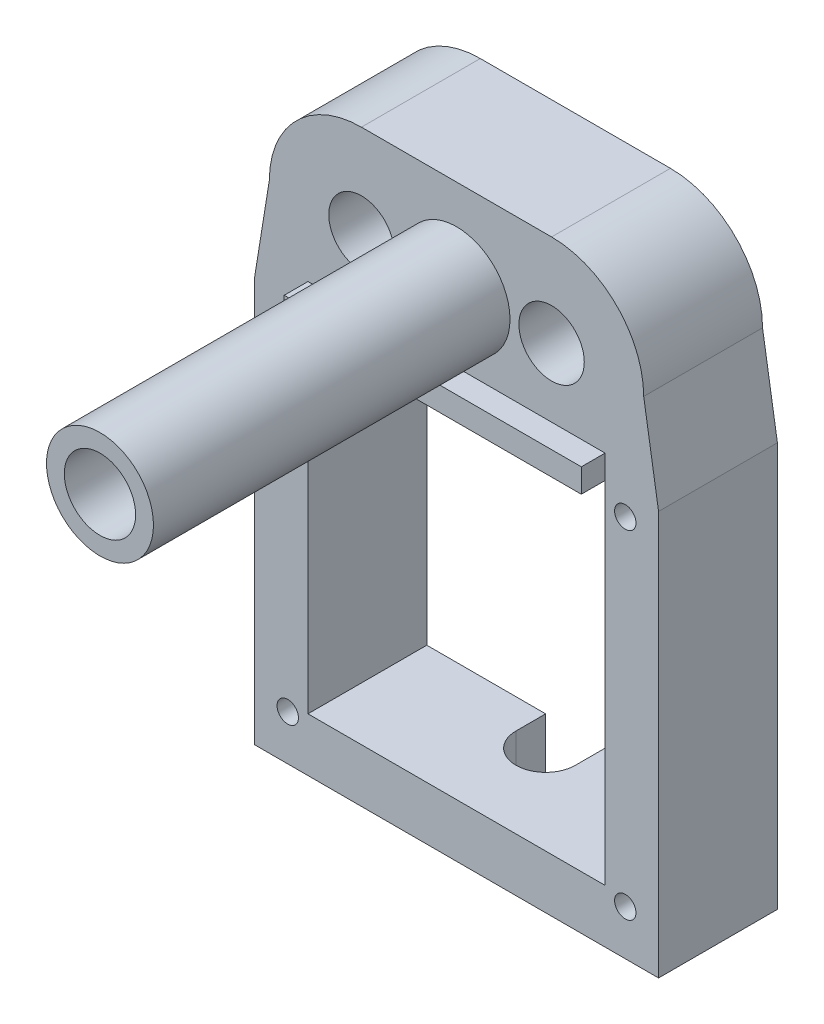
ISO-10303-21;
HEADER;
FILE_DESCRIPTION(('STEP AP214'),'2;1');
FILE_NAME('part.step','',(''),(''),'','','');
FILE_SCHEMA(('AUTOMOTIVE_DESIGN { 1 0 10303 214 1 1 1 1 }'));
ENDSEC;
DATA;
#1=APPLICATION_CONTEXT('core data for automotive mechanical design processes');
#2=APPLICATION_PROTOCOL_DEFINITION('international standard','automotive_design',2000,#1);
#3=PRODUCT_CONTEXT('',#1,'mechanical');
#4=PRODUCT('Part','Part','',(#3));
#5=PRODUCT_RELATED_PRODUCT_CATEGORY('part','',(#4));
#6=PRODUCT_DEFINITION_FORMATION('','',#4);
#7=PRODUCT_DEFINITION_CONTEXT('part definition',#1,'design');
#8=PRODUCT_DEFINITION('design','',#6,#7);
#9=PRODUCT_DEFINITION_SHAPE('','',#8);
#10=(LENGTH_UNIT() NAMED_UNIT(*) SI_UNIT(.MILLI.,.METRE.));
#11=(NAMED_UNIT(*) PLANE_ANGLE_UNIT() SI_UNIT($,.RADIAN.));
#12=(NAMED_UNIT(*) SI_UNIT($,.STERADIAN.) SOLID_ANGLE_UNIT());
#13=UNCERTAINTY_MEASURE_WITH_UNIT(LENGTH_MEASURE(1.E-05),#10,'distance_accuracy_value','');
#14=(GEOMETRIC_REPRESENTATION_CONTEXT(3) GLOBAL_UNCERTAINTY_ASSIGNED_CONTEXT((#13)) GLOBAL_UNIT_ASSIGNED_CONTEXT((#10,
#11,#12)) REPRESENTATION_CONTEXT('',''));
#15=CARTESIAN_POINT('',(0.,0.,0.));
#16=DIRECTION('',(0.,0.,1.));
#17=DIRECTION('',(1.,0.,0.));
#18=AXIS2_PLACEMENT_3D('',#15,#16,#17);
#19=CARTESIAN_POINT('',(0.,0.,10.));
#20=DIRECTION('',(0.,0.,1.));
#21=DIRECTION('',(1.,0.,0.));
#22=AXIS2_PLACEMENT_3D('',#19,#20,#21);
#23=PLANE('',#22);
#24=CARTESIAN_POINT('',(-14.2,-37.95,10.));
#25=DIRECTION('',(0.,0.,1.));
#26=DIRECTION('',(-1.,0.,0.));
#27=AXIS2_PLACEMENT_3D('',#24,#25,#26);
#28=CIRCLE('',#27,0.900000000000002);
#29=CARTESIAN_POINT('',(-15.1,-37.95,10.));
#30=VERTEX_POINT('',#29);
#31=EDGE_CURVE('E756',#30,#30,#28,.T.);
#32=ORIENTED_EDGE('',*,*,#31,.F.);
#33=EDGE_LOOP('',(#32));
#34=FACE_BOUND('',#33,.T.);
#35=CARTESIAN_POINT('',(14.2,-37.95,10.));
#36=DIRECTION('',(0.,0.,1.));
#37=DIRECTION('',(1.,0.,0.));
#38=AXIS2_PLACEMENT_3D('',#35,#36,#37);
#39=CIRCLE('',#38,0.900000000000002);
#40=CARTESIAN_POINT('',(15.1,-37.95,10.));
#41=VERTEX_POINT('',#40);
#42=EDGE_CURVE('E758',#41,#41,#39,.T.);
#43=ORIENTED_EDGE('',*,*,#42,.F.);
#44=EDGE_LOOP('',(#43));
#45=FACE_BOUND('',#44,.T.);
#46=CARTESIAN_POINT('',(14.2,-9.55,10.));
#47=DIRECTION('',(0.,0.,1.));
#48=DIRECTION('',(-1.,0.,0.));
#49=AXIS2_PLACEMENT_3D('',#46,#47,#48);
#50=CIRCLE('',#49,0.9);
#51=CARTESIAN_POINT('',(13.3,-9.55,10.));
#52=VERTEX_POINT('',#51);
#53=EDGE_CURVE('E762',#52,#52,#50,.T.);
#54=ORIENTED_EDGE('',*,*,#53,.F.);
#55=EDGE_LOOP('',(#54));
#56=FACE_BOUND('',#55,.T.);
#57=CARTESIAN_POINT('',(-14.2,-9.55,10.));
#58=DIRECTION('',(0.,0.,1.));
#59=DIRECTION('',(1.,0.,0.));
#60=AXIS2_PLACEMENT_3D('',#57,#58,#59);
#61=CIRCLE('',#60,0.9);
#62=CARTESIAN_POINT('',(-13.3,-9.55,10.));
#63=VERTEX_POINT('',#62);
#64=EDGE_CURVE('E398',#63,#63,#61,.T.);
#65=ORIENTED_EDGE('',*,*,#64,.F.);
#66=EDGE_LOOP('',(#65));
#67=FACE_BOUND('',#66,.T.);
#68=DIRECTION('',(-0.159232438824621,0.987241120712647,0.));
#69=VECTOR('',#68,1.);
#70=CARTESIAN_POINT('',(15.3506592292089,2.47591277890467,10.));
#71=LINE('',#70,#69);
#72=CARTESIAN_POINT('',(17.,-7.75,10.));
#73=VERTEX_POINT('',#72);
#74=CARTESIAN_POINT('',(15.75,0.,10.));
#75=VERTEX_POINT('',#74);
#76=EDGE_CURVE('E264',#73,#75,#71,.T.);
#77=ORIENTED_EDGE('',*,*,#76,.T.);
#78=CARTESIAN_POINT('',(8.,0.,10.));
#79=DIRECTION('',(0.,0.,1.));
#80=DIRECTION('',(1.,0.,0.));
#81=AXIS2_PLACEMENT_3D('',#78,#79,#80);
#82=CIRCLE('',#81,7.75);
#83=CARTESIAN_POINT('',(8.,7.75,10.));
#84=VERTEX_POINT('',#83);
#85=EDGE_CURVE('E348',#75,#84,#82,.T.);
#86=ORIENTED_EDGE('',*,*,#85,.T.);
#87=DIRECTION('',(1.,0.,0.));
#88=VECTOR('',#87,1.);
#89=CARTESIAN_POINT('',(0.,7.75,10.));
#90=LINE('',#89,#88);
#91=CARTESIAN_POINT('',(-8.,7.75,10.));
#92=VERTEX_POINT('',#91);
#93=EDGE_CURVE('E351',#92,#84,#90,.T.);
#94=ORIENTED_EDGE('',*,*,#93,.F.);
#95=CARTESIAN_POINT('',(-8.,0.,10.));
#96=DIRECTION('',(0.,0.,1.));
#97=DIRECTION('',(1.,0.,0.));
#98=AXIS2_PLACEMENT_3D('',#95,#96,#97);
#99=CIRCLE('',#98,7.75);
#100=CARTESIAN_POINT('',(-15.75,0.,10.));
#101=VERTEX_POINT('',#100);
#102=EDGE_CURVE('E356',#92,#101,#99,.T.);
#103=ORIENTED_EDGE('',*,*,#102,.T.);
#104=DIRECTION('',(-0.159232438824621,-0.987241120712647,0.));
#105=VECTOR('',#104,1.);
#106=CARTESIAN_POINT('',(-15.3506592292089,2.47591277890467,10.));
#107=LINE('',#106,#105);
#108=CARTESIAN_POINT('',(-17.,-7.75,10.));
#109=VERTEX_POINT('',#108);
#110=EDGE_CURVE('E251',#101,#109,#107,.T.);
#111=ORIENTED_EDGE('',*,*,#110,.T.);
#112=DIRECTION('',(0.,-1.,0.));
#113=VECTOR('',#112,1.);
#114=CARTESIAN_POINT('',(-17.,0.,10.));
#115=LINE('',#114,#113);
#116=CARTESIAN_POINT('',(-17.,-41.75,10.));
#117=VERTEX_POINT('',#116);
#118=EDGE_CURVE('E254',#109,#117,#115,.T.);
#119=ORIENTED_EDGE('',*,*,#118,.T.);
#120=DIRECTION('',(1.,0.,0.));
#121=VECTOR('',#120,1.);
#122=CARTESIAN_POINT('',(0.,-41.75,10.));
#123=LINE('',#122,#121);
#124=CARTESIAN_POINT('',(17.,-41.75,10.));
#125=VERTEX_POINT('',#124);
#126=EDGE_CURVE('E257',#117,#125,#123,.T.);
#127=ORIENTED_EDGE('',*,*,#126,.T.);
#128=DIRECTION('',(0.,-1.,0.));
#129=VECTOR('',#128,1.);
#130=CARTESIAN_POINT('',(17.,0.,10.));
#131=LINE('',#130,#129);
#132=EDGE_CURVE('E260',#73,#125,#131,.T.);
#133=ORIENTED_EDGE('',*,*,#132,.F.);
#134=EDGE_LOOP('',(#77,#86,#94,#103,#111,#119,#127,#133));
#135=FACE_BOUND('',#134,.T.);
#136=CARTESIAN_POINT('',(-8.,0.,10.));
#137=DIRECTION('',(0.,0.,1.));
#138=DIRECTION('',(1.,0.,0.));
#139=AXIS2_PLACEMENT_3D('',#136,#137,#138);
#140=CIRCLE('',#139,2.75);
#141=CARTESIAN_POINT('',(-5.25,0.,10.));
#142=VERTEX_POINT('',#141);
#143=EDGE_CURVE('E364',#142,#142,#140,.T.);
#144=ORIENTED_EDGE('',*,*,#143,.F.);
#145=EDGE_LOOP('',(#144));
#146=FACE_BOUND('',#145,.T.);
#147=CARTESIAN_POINT('',(8.,0.,10.));
#148=DIRECTION('',(0.,0.,1.));
#149=DIRECTION('',(1.,0.,0.));
#150=AXIS2_PLACEMENT_3D('',#147,#148,#149);
#151=CIRCLE('',#150,2.75);
#152=CARTESIAN_POINT('',(10.75,0.,10.));
#153=VERTEX_POINT('',#152);
#154=EDGE_CURVE('E360',#153,#153,#151,.T.);
#155=ORIENTED_EDGE('',*,*,#154,.F.);
#156=EDGE_LOOP('',(#155));
#157=FACE_BOUND('',#156,.T.);
#158=CARTESIAN_POINT('',(0.,0.,10.));
#159=DIRECTION('',(0.,0.,1.));
#160=DIRECTION('',(1.,0.,0.));
#161=AXIS2_PLACEMENT_3D('',#158,#159,#160);
#162=CIRCLE('',#161,4.5);
#163=CARTESIAN_POINT('',(4.5,0.,10.));
#164=VERTEX_POINT('',#163);
#165=EDGE_CURVE('E339',#164,#164,#162,.T.);
#166=ORIENTED_EDGE('',*,*,#165,.F.);
#167=EDGE_LOOP('',(#166));
#168=FACE_BOUND('',#167,.T.);
#169=DIRECTION('',(0.,-1.,0.));
#170=VECTOR('',#169,1.);
#171=CARTESIAN_POINT('',(-12.5,0.,10.));
#172=LINE('',#171,#170);
#173=CARTESIAN_POINT('',(-12.5,-7.75,10.));
#174=VERTEX_POINT('',#173);
#175=CARTESIAN_POINT('',(-12.5,-37.25,10.));
#176=VERTEX_POINT('',#175);
#177=EDGE_CURVE('E247',#174,#176,#172,.T.);
#178=ORIENTED_EDGE('',*,*,#177,.F.);
#179=DIRECTION('',(0.,-1.,0.));
#180=VECTOR('',#179,1.);
#181=CARTESIAN_POINT('',(-12.5,-7.75,10.));
#182=LINE('',#181,#180);
#183=CARTESIAN_POINT('',(-12.5,-5.75,10.));
#184=VERTEX_POINT('',#183);
#185=EDGE_CURVE('E63',#184,#174,#182,.T.);
#186=ORIENTED_EDGE('',*,*,#185,.F.);
#187=DIRECTION('',(-1.,0.,0.));
#188=VECTOR('',#187,1.);
#189=CARTESIAN_POINT('',(-12.5,-5.75,10.));
#190=LINE('',#189,#188);
#191=CARTESIAN_POINT('',(12.5,-5.75,10.));
#192=VERTEX_POINT('',#191);
#193=EDGE_CURVE('E58',#192,#184,#190,.T.);
#194=ORIENTED_EDGE('',*,*,#193,.F.);
#195=DIRECTION('',(0.,1.,0.));
#196=VECTOR('',#195,1.);
#197=CARTESIAN_POINT('',(12.5,-7.75,10.));
#198=LINE('',#197,#196);
#199=CARTESIAN_POINT('',(12.5,-7.75,10.));
#200=VERTEX_POINT('',#199);
#201=EDGE_CURVE('E411',#200,#192,#198,.T.);
#202=ORIENTED_EDGE('',*,*,#201,.F.);
#203=DIRECTION('',(0.,1.,0.));
#204=VECTOR('',#203,1.);
#205=CARTESIAN_POINT('',(12.5,0.,10.));
#206=LINE('',#205,#204);
#207=CARTESIAN_POINT('',(12.5,-37.25,10.));
#208=VERTEX_POINT('',#207);
#209=EDGE_CURVE('E239',#208,#200,#206,.T.);
#210=ORIENTED_EDGE('',*,*,#209,.F.);
#211=DIRECTION('',(1.,0.,0.));
#212=VECTOR('',#211,1.);
#213=CARTESIAN_POINT('',(0.,-37.25,10.));
#214=LINE('',#213,#212);
#215=EDGE_CURVE('E242',#176,#208,#214,.T.);
#216=ORIENTED_EDGE('',*,*,#215,.F.);
#217=EDGE_LOOP('',(#178,#186,#194,#202,#210,#216));
#218=FACE_BOUND('',#217,.T.);
#219=ADVANCED_FACE('F40',(#34,#45,#56,#67,#135,#146,#157,#168,#218),#23,.T.);
#220=CARTESIAN_POINT('',(8.,0.,10.));
#221=DIRECTION('',(0.,0.,-1.));
#222=DIRECTION('',(-1.,0.,0.));
#223=AXIS2_PLACEMENT_3D('',#220,#221,#222);
#224=CYLINDRICAL_SURFACE('',#223,7.75);
#225=DIRECTION('',(0.,0.,-1.));
#226=VECTOR('',#225,1.);
#227=CARTESIAN_POINT('',(15.75,0.,10.));
#228=LINE('',#227,#226);
#229=CARTESIAN_POINT('',(15.75,0.,0.));
#230=VERTEX_POINT('',#229);
#231=EDGE_CURVE('E302',#75,#230,#228,.T.);
#232=ORIENTED_EDGE('',*,*,#231,.T.);
#233=CARTESIAN_POINT('',(8.,0.,0.));
#234=DIRECTION('',(0.,0.,1.));
#235=DIRECTION('',(1.,0.,0.));
#236=AXIS2_PLACEMENT_3D('',#233,#234,#235);
#237=CIRCLE('',#236,7.75);
#238=CARTESIAN_POINT('',(8.,7.75,0.));
#239=VERTEX_POINT('',#238);
#240=EDGE_CURVE('E371',#230,#239,#237,.T.);
#241=ORIENTED_EDGE('',*,*,#240,.T.);
#242=DIRECTION('',(0.,0.,-1.));
#243=VECTOR('',#242,1.);
#244=CARTESIAN_POINT('',(8.,7.75,10.));
#245=LINE('',#244,#243);
#246=EDGE_CURVE('E11',#84,#239,#245,.T.);
#247=ORIENTED_EDGE('',*,*,#246,.F.);
#248=ORIENTED_EDGE('',*,*,#85,.F.);
#249=EDGE_LOOP('',(#232,#241,#247,#248));
#250=FACE_BOUND('',#249,.T.);
#251=ADVANCED_FACE('F493',(#250),#224,.T.);
#252=CARTESIAN_POINT('',(-8.,0.,10.));
#253=DIRECTION('',(0.,0.,-1.));
#254=DIRECTION('',(-1.,0.,0.));
#255=AXIS2_PLACEMENT_3D('',#252,#253,#254);
#256=CYLINDRICAL_SURFACE('',#255,7.75);
#257=DIRECTION('',(0.,0.,-1.));
#258=VECTOR('',#257,1.);
#259=CARTESIAN_POINT('',(-15.75,0.,10.));
#260=LINE('',#259,#258);
#261=CARTESIAN_POINT('',(-15.75,0.,0.));
#262=VERTEX_POINT('',#261);
#263=EDGE_CURVE('E321',#101,#262,#260,.T.);
#264=ORIENTED_EDGE('',*,*,#263,.F.);
#265=ORIENTED_EDGE('',*,*,#102,.F.);
#266=DIRECTION('',(0.,0.,-1.));
#267=VECTOR('',#266,1.);
#268=CARTESIAN_POINT('',(-8.,7.75,10.));
#269=LINE('',#268,#267);
#270=CARTESIAN_POINT('',(-8.,7.75,0.));
#271=VERTEX_POINT('',#270);
#272=EDGE_CURVE('E50',#92,#271,#269,.T.);
#273=ORIENTED_EDGE('',*,*,#272,.T.);
#274=CARTESIAN_POINT('',(-8.,0.,0.));
#275=DIRECTION('',(0.,0.,1.));
#276=DIRECTION('',(1.,0.,0.));
#277=AXIS2_PLACEMENT_3D('',#274,#275,#276);
#278=CIRCLE('',#277,7.75);
#279=EDGE_CURVE('E378',#271,#262,#278,.T.);
#280=ORIENTED_EDGE('',*,*,#279,.T.);
#281=EDGE_LOOP('',(#264,#265,#273,#280));
#282=FACE_BOUND('',#281,.T.);
#283=ADVANCED_FACE('F501',(#282),#256,.T.);
#284=CARTESIAN_POINT('',(0.,-7.75,10.));
#285=DIRECTION('',(0.,1.,0.));
#286=DIRECTION('',(-1.,0.,0.));
#287=AXIS2_PLACEMENT_3D('',#284,#285,#286);
#288=PLANE('',#287);
#289=DIRECTION('',(1.,0.,0.));
#290=VECTOR('',#289,1.);
#291=CARTESIAN_POINT('',(0.,-7.75,0.));
#292=LINE('',#291,#290);
#293=CARTESIAN_POINT('',(-12.5,-7.75,0.));
#294=VERTEX_POINT('',#293);
#295=CARTESIAN_POINT('',(12.5,-7.75,0.));
#296=VERTEX_POINT('',#295);
#297=EDGE_CURVE('E368',#294,#296,#292,.T.);
#298=ORIENTED_EDGE('',*,*,#297,.T.);
#299=DIRECTION('',(0.,0.,-1.));
#300=VECTOR('',#299,1.);
#301=CARTESIAN_POINT('',(12.5,-7.75,10.));
#302=LINE('',#301,#300);
#303=EDGE_CURVE('E268',#200,#296,#302,.T.);
#304=ORIENTED_EDGE('',*,*,#303,.F.);
#305=DIRECTION('',(0.,0.,-1.));
#306=VECTOR('',#305,1.);
#307=CARTESIAN_POINT('',(12.5,-7.75,12.));
#308=LINE('',#307,#306);
#309=CARTESIAN_POINT('',(12.5,-7.75,12.));
#310=VERTEX_POINT('',#309);
#311=EDGE_CURVE('E181',#310,#200,#308,.T.);
#312=ORIENTED_EDGE('',*,*,#311,.F.);
#313=DIRECTION('',(1.,0.,0.));
#314=VECTOR('',#313,1.);
#315=CARTESIAN_POINT('',(-12.5,-7.75,12.));
#316=LINE('',#315,#314);
#317=CARTESIAN_POINT('',(-12.5,-7.75,12.));
#318=VERTEX_POINT('',#317);
#319=EDGE_CURVE('E174',#318,#310,#316,.T.);
#320=ORIENTED_EDGE('',*,*,#319,.F.);
#321=DIRECTION('',(0.,0.,-1.));
#322=VECTOR('',#321,1.);
#323=CARTESIAN_POINT('',(-12.5,-7.75,12.));
#324=LINE('',#323,#322);
#325=EDGE_CURVE('E178',#318,#174,#324,.T.);
#326=ORIENTED_EDGE('',*,*,#325,.T.);
#327=DIRECTION('',(0.,0.,-1.));
#328=VECTOR('',#327,1.);
#329=CARTESIAN_POINT('',(-12.5,-7.75,10.));
#330=LINE('',#329,#328);
#331=EDGE_CURVE('E325',#174,#294,#330,.T.);
#332=ORIENTED_EDGE('',*,*,#331,.T.);
#333=EDGE_LOOP('',(#298,#304,#312,#320,#326,#332));
#334=FACE_BOUND('',#333,.T.);
#335=ADVANCED_FACE('F42',(#334),#288,.F.);
#336=CARTESIAN_POINT('',(0.,7.75,10.));
#337=DIRECTION('',(0.,1.,0.));
#338=DIRECTION('',(-1.,0.,0.));
#339=AXIS2_PLACEMENT_3D('',#336,#337,#338);
#340=PLANE('',#339);
#341=DIRECTION('',(1.,0.,0.));
#342=VECTOR('',#341,1.);
#343=CARTESIAN_POINT('',(0.,7.75,0.));
#344=LINE('',#343,#342);
#345=EDGE_CURVE('E374',#271,#239,#344,.T.);
#346=ORIENTED_EDGE('',*,*,#345,.F.);
#347=ORIENTED_EDGE('',*,*,#272,.F.);
#348=ORIENTED_EDGE('',*,*,#93,.T.);
#349=ORIENTED_EDGE('',*,*,#246,.T.);
#350=EDGE_LOOP('',(#346,#347,#348,#349));
#351=FACE_BOUND('',#350,.T.);
#352=ADVANCED_FACE('F517',(#351),#340,.T.);
#353=CARTESIAN_POINT('',(8.,0.,10.));
#354=DIRECTION('',(0.,0.,-1.));
#355=DIRECTION('',(-1.,0.,0.));
#356=AXIS2_PLACEMENT_3D('',#353,#354,#355);
#357=CYLINDRICAL_SURFACE('',#356,2.75);
#358=ORIENTED_EDGE('',*,*,#154,.T.);
#359=EDGE_LOOP('',(#358));
#360=FACE_BOUND('',#359,.T.);
#361=CARTESIAN_POINT('',(8.,0.,0.));
#362=DIRECTION('',(0.,0.,1.));
#363=DIRECTION('',(1.,0.,0.));
#364=AXIS2_PLACEMENT_3D('',#361,#362,#363);
#365=CIRCLE('',#364,2.75);
#366=CARTESIAN_POINT('',(10.75,0.,0.));
#367=VERTEX_POINT('',#366);
#368=EDGE_CURVE('E381',#367,#367,#365,.T.);
#369=ORIENTED_EDGE('',*,*,#368,.F.);
#370=EDGE_LOOP('',(#369));
#371=FACE_BOUND('',#370,.T.);
#372=ADVANCED_FACE('F513',(#360,#371),#357,.F.);
#373=CARTESIAN_POINT('',(-8.,0.,10.));
#374=DIRECTION('',(0.,0.,-1.));
#375=DIRECTION('',(-1.,0.,0.));
#376=AXIS2_PLACEMENT_3D('',#373,#374,#375);
#377=CYLINDRICAL_SURFACE('',#376,2.75);
#378=ORIENTED_EDGE('',*,*,#143,.T.);
#379=EDGE_LOOP('',(#378));
#380=FACE_BOUND('',#379,.T.);
#381=CARTESIAN_POINT('',(-8.,0.,0.));
#382=DIRECTION('',(0.,0.,1.));
#383=DIRECTION('',(1.,0.,0.));
#384=AXIS2_PLACEMENT_3D('',#381,#382,#383);
#385=CIRCLE('',#384,2.75);
#386=CARTESIAN_POINT('',(-5.25,0.,0.));
#387=VERTEX_POINT('',#386);
#388=EDGE_CURVE('E352',#387,#387,#385,.T.);
#389=ORIENTED_EDGE('',*,*,#388,.F.);
#390=EDGE_LOOP('',(#389));
#391=FACE_BOUND('',#390,.T.);
#392=ADVANCED_FACE('F510',(#380,#391),#377,.F.);
#393=CARTESIAN_POINT('',(0.,0.,0.));
#394=DIRECTION('',(0.,0.,1.));
#395=DIRECTION('',(1.,0.,0.));
#396=AXIS2_PLACEMENT_3D('',#393,#394,#395);
#397=PLANE('',#396);
#398=CARTESIAN_POINT('',(-14.2,-37.95,0.));
#399=DIRECTION('',(0.,0.,1.));
#400=DIRECTION('',(1.,0.,0.));
#401=AXIS2_PLACEMENT_3D('',#398,#399,#400);
#402=CIRCLE('',#401,0.900000000000002);
#403=CARTESIAN_POINT('',(-13.3,-37.95,0.));
#404=VERTEX_POINT('',#403);
#405=EDGE_CURVE('E44',#404,#404,#402,.T.);
#406=ORIENTED_EDGE('',*,*,#405,.T.);
#407=EDGE_LOOP('',(#406));
#408=FACE_BOUND('',#407,.T.);
#409=CARTESIAN_POINT('',(14.2,-37.95,0.));
#410=DIRECTION('',(0.,0.,1.));
#411=DIRECTION('',(1.,0.,0.));
#412=AXIS2_PLACEMENT_3D('',#409,#410,#411);
#413=CIRCLE('',#412,0.900000000000002);
#414=CARTESIAN_POINT('',(15.1,-37.95,0.));
#415=VERTEX_POINT('',#414);
#416=EDGE_CURVE('E401',#415,#415,#413,.T.);
#417=ORIENTED_EDGE('',*,*,#416,.T.);
#418=EDGE_LOOP('',(#417));
#419=FACE_BOUND('',#418,.T.);
#420=CARTESIAN_POINT('',(14.2,-9.55,0.));
#421=DIRECTION('',(0.,0.,1.));
#422=DIRECTION('',(1.,0.,0.));
#423=AXIS2_PLACEMENT_3D('',#420,#421,#422);
#424=CIRCLE('',#423,0.9);
#425=CARTESIAN_POINT('',(15.1,-9.55,0.));
#426=VERTEX_POINT('',#425);
#427=EDGE_CURVE('E397',#426,#426,#424,.T.);
#428=ORIENTED_EDGE('',*,*,#427,.T.);
#429=EDGE_LOOP('',(#428));
#430=FACE_BOUND('',#429,.T.);
#431=CARTESIAN_POINT('',(-14.2,-9.55,0.));
#432=DIRECTION('',(0.,0.,1.));
#433=DIRECTION('',(1.,0.,0.));
#434=AXIS2_PLACEMENT_3D('',#431,#432,#433);
#435=CIRCLE('',#434,0.9);
#436=CARTESIAN_POINT('',(-13.3,-9.55,0.));
#437=VERTEX_POINT('',#436);
#438=EDGE_CURVE('E393',#437,#437,#435,.T.);
#439=ORIENTED_EDGE('',*,*,#438,.T.);
#440=EDGE_LOOP('',(#439));
#441=FACE_BOUND('',#440,.T.);
#442=DIRECTION('',(1.,0.,0.));
#443=VECTOR('',#442,1.);
#444=CARTESIAN_POINT('',(0.,-41.75,0.));
#445=LINE('',#444,#443);
#446=CARTESIAN_POINT('',(2.5,-41.75,0.));
#447=VERTEX_POINT('',#446);
#448=CARTESIAN_POINT('',(17.,-41.75,0.));
#449=VERTEX_POINT('',#448);
#450=EDGE_CURVE('E287',#447,#449,#445,.T.);
#451=ORIENTED_EDGE('',*,*,#450,.F.);
#452=DIRECTION('',(0.,-1.,0.));
#453=VECTOR('',#452,1.);
#454=CARTESIAN_POINT('',(2.5,-31.75,0.));
#455=LINE('',#454,#453);
#456=CARTESIAN_POINT('',(2.5,-37.25,0.));
#457=VERTEX_POINT('',#456);
#458=EDGE_CURVE('E220',#457,#447,#455,.T.);
#459=ORIENTED_EDGE('',*,*,#458,.F.);
#460=DIRECTION('',(1.,0.,0.));
#461=VECTOR('',#460,1.);
#462=CARTESIAN_POINT('',(0.,-37.25,0.));
#463=LINE('',#462,#461);
#464=CARTESIAN_POINT('',(12.5,-37.25,0.));
#465=VERTEX_POINT('',#464);
#466=EDGE_CURVE('E272',#457,#465,#463,.T.);
#467=ORIENTED_EDGE('',*,*,#466,.T.);
#468=DIRECTION('',(0.,1.,0.));
#469=VECTOR('',#468,1.);
#470=CARTESIAN_POINT('',(12.5,0.,0.));
#471=LINE('',#470,#469);
#472=EDGE_CURVE('E238',#465,#296,#471,.T.);
#473=ORIENTED_EDGE('',*,*,#472,.T.);
#474=ORIENTED_EDGE('',*,*,#297,.F.);
#475=DIRECTION('',(0.,-1.,0.));
#476=VECTOR('',#475,1.);
#477=CARTESIAN_POINT('',(-12.5,0.,0.));
#478=LINE('',#477,#476);
#479=CARTESIAN_POINT('',(-12.5,-37.25,0.));
#480=VERTEX_POINT('',#479);
#481=EDGE_CURVE('E277',#294,#480,#478,.T.);
#482=ORIENTED_EDGE('',*,*,#481,.T.);
#483=CARTESIAN_POINT('',(-2.5,-37.25,0.));
#484=VERTEX_POINT('',#483);
#485=EDGE_CURVE('E273',#480,#484,#463,.T.);
#486=ORIENTED_EDGE('',*,*,#485,.T.);
#487=DIRECTION('',(0.,-1.,0.));
#488=VECTOR('',#487,1.);
#489=CARTESIAN_POINT('',(-2.5,-31.75,0.));
#490=LINE('',#489,#488);
#491=CARTESIAN_POINT('',(-2.5,-41.75,0.));
#492=VERTEX_POINT('',#491);
#493=EDGE_CURVE('E223',#484,#492,#490,.T.);
#494=ORIENTED_EDGE('',*,*,#493,.T.);
#495=CARTESIAN_POINT('',(-17.,-41.75,0.));
#496=VERTEX_POINT('',#495);
#497=EDGE_CURVE('E288',#496,#492,#445,.T.);
#498=ORIENTED_EDGE('',*,*,#497,.F.);
#499=DIRECTION('',(0.,-1.,0.));
#500=VECTOR('',#499,1.);
#501=CARTESIAN_POINT('',(-17.,0.,0.));
#502=LINE('',#501,#500);
#503=CARTESIAN_POINT('',(-17.,-7.75,0.));
#504=VERTEX_POINT('',#503);
#505=EDGE_CURVE('E284',#504,#496,#502,.T.);
#506=ORIENTED_EDGE('',*,*,#505,.F.);
#507=DIRECTION('',(-0.159232438824621,-0.987241120712647,0.));
#508=VECTOR('',#507,1.);
#509=CARTESIAN_POINT('',(-15.3506592292089,2.47591277890467,0.));
#510=LINE('',#509,#508);
#511=EDGE_CURVE('E281',#262,#504,#510,.T.);
#512=ORIENTED_EDGE('',*,*,#511,.F.);
#513=ORIENTED_EDGE('',*,*,#279,.F.);
#514=ORIENTED_EDGE('',*,*,#345,.T.);
#515=ORIENTED_EDGE('',*,*,#240,.F.);
#516=DIRECTION('',(-0.159232438824621,0.987241120712647,0.));
#517=VECTOR('',#516,1.);
#518=CARTESIAN_POINT('',(15.3506592292089,2.47591277890467,0.));
#519=LINE('',#518,#517);
#520=CARTESIAN_POINT('',(17.,-7.75,0.));
#521=VERTEX_POINT('',#520);
#522=EDGE_CURVE('E243',#521,#230,#519,.T.);
#523=ORIENTED_EDGE('',*,*,#522,.F.);
#524=DIRECTION('',(0.,-1.,0.));
#525=VECTOR('',#524,1.);
#526=CARTESIAN_POINT('',(17.,0.,0.));
#527=LINE('',#526,#525);
#528=EDGE_CURVE('E292',#521,#449,#527,.T.);
#529=ORIENTED_EDGE('',*,*,#528,.T.);
#530=EDGE_LOOP('',(#451,#459,#467,#473,#474,#482,#486,#494,#498,#506,#512,#513,#514,#515,#523,#529));
#531=FACE_BOUND('',#530,.T.);
#532=CARTESIAN_POINT('',(0.,0.,0.));
#533=DIRECTION('',(0.,0.,1.));
#534=DIRECTION('',(1.,0.,0.));
#535=AXIS2_PLACEMENT_3D('',#532,#533,#534);
#536=CIRCLE('',#535,3.);
#537=CARTESIAN_POINT('',(3.,0.,0.));
#538=VERTEX_POINT('',#537);
#539=EDGE_CURVE('E344',#538,#538,#536,.T.);
#540=ORIENTED_EDGE('',*,*,#539,.T.);
#541=EDGE_LOOP('',(#540));
#542=FACE_BOUND('',#541,.T.);
#543=ORIENTED_EDGE('',*,*,#368,.T.);
#544=EDGE_LOOP('',(#543));
#545=FACE_BOUND('',#544,.T.);
#546=ORIENTED_EDGE('',*,*,#388,.T.);
#547=EDGE_LOOP('',(#546));
#548=FACE_BOUND('',#547,.T.);
#549=ADVANCED_FACE('F445',(#408,#419,#430,#441,#531,#542,#545,#548),#397,.F.);
#550=CARTESIAN_POINT('',(0.,0.,-5.));
#551=DIRECTION('',(0.,0.,1.));
#552=DIRECTION('',(1.,0.,0.));
#553=AXIS2_PLACEMENT_3D('',#550,#551,#552);
#554=CYLINDRICAL_SURFACE('',#553,3.);
#555=ORIENTED_EDGE('',*,*,#539,.F.);
#556=EDGE_LOOP('',(#555));
#557=FACE_BOUND('',#556,.T.);
#558=CARTESIAN_POINT('',(0.,0.,40.));
#559=DIRECTION('',(0.,0.,1.));
#560=DIRECTION('',(1.,0.,0.));
#561=AXIS2_PLACEMENT_3D('',#558,#559,#560);
#562=CIRCLE('',#561,3.);
#563=CARTESIAN_POINT('',(3.,0.,40.));
#564=VERTEX_POINT('',#563);
#565=EDGE_CURVE('E335',#564,#564,#562,.T.);
#566=ORIENTED_EDGE('',*,*,#565,.T.);
#567=EDGE_LOOP('',(#566));
#568=FACE_BOUND('',#567,.T.);
#569=ADVANCED_FACE('F507',(#557,#568),#554,.F.);
#570=CARTESIAN_POINT('',(0.,0.,40.));
#571=DIRECTION('',(0.,0.,1.));
#572=DIRECTION('',(1.,0.,0.));
#573=AXIS2_PLACEMENT_3D('',#570,#571,#572);
#574=PLANE('',#573);
#575=CARTESIAN_POINT('',(0.,0.,40.));
#576=DIRECTION('',(0.,0.,1.));
#577=DIRECTION('',(1.,0.,0.));
#578=AXIS2_PLACEMENT_3D('',#575,#576,#577);
#579=CIRCLE('',#578,4.5);
#580=CARTESIAN_POINT('',(4.5,0.,40.));
#581=VERTEX_POINT('',#580);
#582=EDGE_CURVE('E340',#581,#581,#579,.T.);
#583=ORIENTED_EDGE('',*,*,#582,.T.);
#584=EDGE_LOOP('',(#583));
#585=FACE_BOUND('',#584,.T.);
#586=ORIENTED_EDGE('',*,*,#565,.F.);
#587=EDGE_LOOP('',(#586));
#588=FACE_BOUND('',#587,.T.);
#589=ADVANCED_FACE('F554',(#585,#588),#574,.T.);
#590=CARTESIAN_POINT('',(0.,0.,40.));
#591=DIRECTION('',(0.,0.,-1.));
#592=DIRECTION('',(-1.,0.,0.));
#593=AXIS2_PLACEMENT_3D('',#590,#591,#592);
#594=CYLINDRICAL_SURFACE('',#593,4.5);
#595=ORIENTED_EDGE('',*,*,#582,.F.);
#596=EDGE_LOOP('',(#595));
#597=FACE_BOUND('',#596,.T.);
#598=ORIENTED_EDGE('',*,*,#165,.T.);
#599=EDGE_LOOP('',(#598));
#600=FACE_BOUND('',#599,.T.);
#601=ADVANCED_FACE('F553',(#597,#600),#594,.T.);
#602=CARTESIAN_POINT('',(12.5,0.,10.));
#603=DIRECTION('',(-1.,0.,0.));
#604=DIRECTION('',(0.,0.,1.));
#605=AXIS2_PLACEMENT_3D('',#602,#603,#604);
#606=PLANE('',#605);
#607=ORIENTED_EDGE('',*,*,#472,.F.);
#608=DIRECTION('',(0.,0.,-1.));
#609=VECTOR('',#608,1.);
#610=CARTESIAN_POINT('',(12.5,-37.25,10.));
#611=LINE('',#610,#609);
#612=EDGE_CURVE('E331',#208,#465,#611,.T.);
#613=ORIENTED_EDGE('',*,*,#612,.F.);
#614=ORIENTED_EDGE('',*,*,#209,.T.);
#615=ORIENTED_EDGE('',*,*,#303,.T.);
#616=EDGE_LOOP('',(#607,#613,#614,#615));
#617=FACE_BOUND('',#616,.T.);
#618=ADVANCED_FACE('F443',(#617),#606,.T.);
#619=CARTESIAN_POINT('',(0.,-37.25,10.));
#620=DIRECTION('',(0.,1.,0.));
#621=DIRECTION('',(0.,0.,1.));
#622=AXIS2_PLACEMENT_3D('',#619,#620,#621);
#623=PLANE('',#622);
#624=DIRECTION('',(0.,0.,-1.));
#625=VECTOR('',#624,1.);
#626=CARTESIAN_POINT('',(2.5,-37.25,10.));
#627=LINE('',#626,#625);
#628=CARTESIAN_POINT('',(2.5,-37.25,2.5));
#629=VERTEX_POINT('',#628);
#630=EDGE_CURVE('E232',#629,#457,#627,.T.);
#631=ORIENTED_EDGE('',*,*,#630,.F.);
#632=CARTESIAN_POINT('',(0.,-37.25,2.5));
#633=DIRECTION('',(0.,1.,0.));
#634=DIRECTION('',(0.,0.,1.));
#635=AXIS2_PLACEMENT_3D('',#632,#633,#634);
#636=CIRCLE('',#635,2.5);
#637=CARTESIAN_POINT('',(-2.5,-37.25,2.5));
#638=VERTEX_POINT('',#637);
#639=EDGE_CURVE('E235',#638,#629,#636,.T.);
#640=ORIENTED_EDGE('',*,*,#639,.F.);
#641=DIRECTION('',(0.,0.,1.));
#642=VECTOR('',#641,1.);
#643=CARTESIAN_POINT('',(-2.5,-37.25,10.));
#644=LINE('',#643,#642);
#645=EDGE_CURVE('E219',#484,#638,#644,.T.);
#646=ORIENTED_EDGE('',*,*,#645,.F.);
#647=ORIENTED_EDGE('',*,*,#485,.F.);
#648=DIRECTION('',(0.,0.,-1.));
#649=VECTOR('',#648,1.);
#650=CARTESIAN_POINT('',(-12.5,-37.25,10.));
#651=LINE('',#650,#649);
#652=EDGE_CURVE('E328',#176,#480,#651,.T.);
#653=ORIENTED_EDGE('',*,*,#652,.F.);
#654=ORIENTED_EDGE('',*,*,#215,.T.);
#655=ORIENTED_EDGE('',*,*,#612,.T.);
#656=ORIENTED_EDGE('',*,*,#466,.F.);
#657=EDGE_LOOP('',(#631,#640,#646,#647,#653,#654,#655,#656));
#658=FACE_BOUND('',#657,.T.);
#659=ADVANCED_FACE('F434',(#658),#623,.T.);
#660=CARTESIAN_POINT('',(-12.5,0.,10.));
#661=DIRECTION('',(1.,0.,0.));
#662=DIRECTION('',(0.,1.,0.));
#663=AXIS2_PLACEMENT_3D('',#660,#661,#662);
#664=PLANE('',#663);
#665=ORIENTED_EDGE('',*,*,#481,.F.);
#666=ORIENTED_EDGE('',*,*,#331,.F.);
#667=ORIENTED_EDGE('',*,*,#177,.T.);
#668=ORIENTED_EDGE('',*,*,#652,.T.);
#669=EDGE_LOOP('',(#665,#666,#667,#668));
#670=FACE_BOUND('',#669,.T.);
#671=ADVANCED_FACE('F441',(#670),#664,.T.);
#672=CARTESIAN_POINT('',(-15.3506592292089,2.47591277890467,10.));
#673=DIRECTION('',(0.987241120712647,-0.159232438824621,0.));
#674=DIRECTION('',(0.159232438824621,0.987241120712647,0.));
#675=AXIS2_PLACEMENT_3D('',#672,#673,#674);
#676=PLANE('',#675);
#677=ORIENTED_EDGE('',*,*,#511,.T.);
#678=DIRECTION('',(0.,0.,-1.));
#679=VECTOR('',#678,1.);
#680=CARTESIAN_POINT('',(-17.,-7.75,10.));
#681=LINE('',#680,#679);
#682=EDGE_CURVE('E317',#109,#504,#681,.T.);
#683=ORIENTED_EDGE('',*,*,#682,.F.);
#684=ORIENTED_EDGE('',*,*,#110,.F.);
#685=ORIENTED_EDGE('',*,*,#263,.T.);
#686=EDGE_LOOP('',(#677,#683,#684,#685));
#687=FACE_BOUND('',#686,.T.);
#688=ADVANCED_FACE('F533',(#687),#676,.F.);
#689=CARTESIAN_POINT('',(-17.,0.,10.));
#690=DIRECTION('',(1.,0.,0.));
#691=DIRECTION('',(0.,1.,0.));
#692=AXIS2_PLACEMENT_3D('',#689,#690,#691);
#693=PLANE('',#692);
#694=ORIENTED_EDGE('',*,*,#505,.T.);
#695=DIRECTION('',(0.,0.,-1.));
#696=VECTOR('',#695,1.);
#697=CARTESIAN_POINT('',(-17.,-41.75,10.));
#698=LINE('',#697,#696);
#699=EDGE_CURVE('E313',#117,#496,#698,.T.);
#700=ORIENTED_EDGE('',*,*,#699,.F.);
#701=ORIENTED_EDGE('',*,*,#118,.F.);
#702=ORIENTED_EDGE('',*,*,#682,.T.);
#703=EDGE_LOOP('',(#694,#700,#701,#702));
#704=FACE_BOUND('',#703,.T.);
#705=ADVANCED_FACE('F536',(#704),#693,.F.);
#706=CARTESIAN_POINT('',(0.,-41.75,10.));
#707=DIRECTION('',(0.,1.,0.));
#708=DIRECTION('',(0.,0.,1.));
#709=AXIS2_PLACEMENT_3D('',#706,#707,#708);
#710=PLANE('',#709);
#711=CARTESIAN_POINT('',(0.,-41.75,2.5));
#712=DIRECTION('',(0.,-1.,0.));
#713=DIRECTION('',(0.,0.,-1.));
#714=AXIS2_PLACEMENT_3D('',#711,#712,#713);
#715=CIRCLE('',#714,2.5);
#716=CARTESIAN_POINT('',(2.5,-41.75,2.5));
#717=VERTEX_POINT('',#716);
#718=CARTESIAN_POINT('',(-2.5,-41.75,2.5));
#719=VERTEX_POINT('',#718);
#720=EDGE_CURVE('E199',#717,#719,#715,.T.);
#721=ORIENTED_EDGE('',*,*,#720,.F.);
#722=DIRECTION('',(0.,0.,1.));
#723=VECTOR('',#722,1.);
#724=CARTESIAN_POINT('',(2.5,-41.75,0.));
#725=LINE('',#724,#723);
#726=EDGE_CURVE('E211',#447,#717,#725,.T.);
#727=ORIENTED_EDGE('',*,*,#726,.F.);
#728=ORIENTED_EDGE('',*,*,#450,.T.);
#729=DIRECTION('',(0.,0.,-1.));
#730=VECTOR('',#729,1.);
#731=CARTESIAN_POINT('',(17.,-41.75,10.));
#732=LINE('',#731,#730);
#733=EDGE_CURVE('E309',#125,#449,#732,.T.);
#734=ORIENTED_EDGE('',*,*,#733,.F.);
#735=ORIENTED_EDGE('',*,*,#126,.F.);
#736=ORIENTED_EDGE('',*,*,#699,.T.);
#737=ORIENTED_EDGE('',*,*,#497,.T.);
#738=DIRECTION('',(0.,0.,-1.));
#739=VECTOR('',#738,1.);
#740=CARTESIAN_POINT('',(-2.5,-41.75,0.));
#741=LINE('',#740,#739);
#742=EDGE_CURVE('E203',#719,#492,#741,.T.);
#743=ORIENTED_EDGE('',*,*,#742,.F.);
#744=EDGE_LOOP('',(#721,#727,#728,#734,#735,#736,#737,#743));
#745=FACE_BOUND('',#744,.T.);
#746=ADVANCED_FACE('F454',(#745),#710,.F.);
#747=CARTESIAN_POINT('',(17.,0.,10.));
#748=DIRECTION('',(1.,0.,0.));
#749=DIRECTION('',(0.,1.,0.));
#750=AXIS2_PLACEMENT_3D('',#747,#748,#749);
#751=PLANE('',#750);
#752=ORIENTED_EDGE('',*,*,#528,.F.);
#753=DIRECTION('',(0.,0.,-1.));
#754=VECTOR('',#753,1.);
#755=CARTESIAN_POINT('',(17.,-7.75,10.));
#756=LINE('',#755,#754);
#757=EDGE_CURVE('E306',#73,#521,#756,.T.);
#758=ORIENTED_EDGE('',*,*,#757,.F.);
#759=ORIENTED_EDGE('',*,*,#132,.T.);
#760=ORIENTED_EDGE('',*,*,#733,.T.);
#761=EDGE_LOOP('',(#752,#758,#759,#760));
#762=FACE_BOUND('',#761,.T.);
#763=ADVANCED_FACE('F458',(#762),#751,.T.);
#764=CARTESIAN_POINT('',(15.3506592292089,2.47591277890467,10.));
#765=DIRECTION('',(-0.987241120712647,-0.159232438824621,0.));
#766=DIRECTION('',(0.159232438824621,-0.987241120712647,0.));
#767=AXIS2_PLACEMENT_3D('',#764,#765,#766);
#768=PLANE('',#767);
#769=ORIENTED_EDGE('',*,*,#522,.T.);
#770=ORIENTED_EDGE('',*,*,#231,.F.);
#771=ORIENTED_EDGE('',*,*,#76,.F.);
#772=ORIENTED_EDGE('',*,*,#757,.T.);
#773=EDGE_LOOP('',(#769,#770,#771,#772));
#774=FACE_BOUND('',#773,.T.);
#775=ADVANCED_FACE('F463',(#774),#768,.F.);
#776=CARTESIAN_POINT('',(0.,-31.75,2.5));
#777=DIRECTION('',(0.,-1.,0.));
#778=DIRECTION('',(0.,0.,-1.));
#779=AXIS2_PLACEMENT_3D('',#776,#777,#778);
#780=CYLINDRICAL_SURFACE('',#779,2.5);
#781=ORIENTED_EDGE('',*,*,#639,.T.);
#782=DIRECTION('',(0.,-1.,0.));
#783=VECTOR('',#782,1.);
#784=CARTESIAN_POINT('',(2.5,-31.75,2.5));
#785=LINE('',#784,#783);
#786=EDGE_CURVE('E216',#629,#717,#785,.T.);
#787=ORIENTED_EDGE('',*,*,#786,.T.);
#788=ORIENTED_EDGE('',*,*,#720,.T.);
#789=DIRECTION('',(0.,-1.,0.));
#790=VECTOR('',#789,1.);
#791=CARTESIAN_POINT('',(-2.5,-31.75,2.5));
#792=LINE('',#791,#790);
#793=EDGE_CURVE('E215',#638,#719,#792,.T.);
#794=ORIENTED_EDGE('',*,*,#793,.F.);
#795=EDGE_LOOP('',(#781,#787,#788,#794));
#796=FACE_BOUND('',#795,.T.);
#797=ADVANCED_FACE('F480',(#796),#780,.F.);
#798=CARTESIAN_POINT('',(2.5,-31.75,0.));
#799=DIRECTION('',(1.,0.,0.));
#800=DIRECTION('',(0.,0.,-1.));
#801=AXIS2_PLACEMENT_3D('',#798,#799,#800);
#802=PLANE('',#801);
#803=ORIENTED_EDGE('',*,*,#630,.T.);
#804=ORIENTED_EDGE('',*,*,#458,.T.);
#805=ORIENTED_EDGE('',*,*,#726,.T.);
#806=ORIENTED_EDGE('',*,*,#786,.F.);
#807=EDGE_LOOP('',(#803,#804,#805,#806));
#808=FACE_BOUND('',#807,.T.);
#809=ADVANCED_FACE('F482',(#808),#802,.F.);
#810=CARTESIAN_POINT('',(-2.5,-31.75,0.));
#811=DIRECTION('',(-1.,0.,0.));
#812=DIRECTION('',(0.,0.,1.));
#813=AXIS2_PLACEMENT_3D('',#810,#811,#812);
#814=PLANE('',#813);
#815=ORIENTED_EDGE('',*,*,#645,.T.);
#816=ORIENTED_EDGE('',*,*,#793,.T.);
#817=ORIENTED_EDGE('',*,*,#742,.T.);
#818=ORIENTED_EDGE('',*,*,#493,.F.);
#819=EDGE_LOOP('',(#815,#816,#817,#818));
#820=FACE_BOUND('',#819,.T.);
#821=ADVANCED_FACE('F475',(#820),#814,.F.);
#822=CARTESIAN_POINT('',(-12.5,-7.75,12.));
#823=DIRECTION('',(1.,0.,0.));
#824=DIRECTION('',(0.,0.,-1.));
#825=AXIS2_PLACEMENT_3D('',#822,#823,#824);
#826=PLANE('',#825);
#827=ORIENTED_EDGE('',*,*,#185,.T.);
#828=ORIENTED_EDGE('',*,*,#325,.F.);
#829=DIRECTION('',(0.,-1.,0.));
#830=VECTOR('',#829,1.);
#831=CARTESIAN_POINT('',(-12.5,-7.75,12.));
#832=LINE('',#831,#830);
#833=CARTESIAN_POINT('',(-12.5,-5.75,12.));
#834=VERTEX_POINT('',#833);
#835=EDGE_CURVE('E186',#834,#318,#832,.T.);
#836=ORIENTED_EDGE('',*,*,#835,.F.);
#837=DIRECTION('',(0.,0.,-1.));
#838=VECTOR('',#837,1.);
#839=CARTESIAN_POINT('',(-12.5,-5.75,12.));
#840=LINE('',#839,#838);
#841=EDGE_CURVE('E420',#834,#184,#840,.T.);
#842=ORIENTED_EDGE('',*,*,#841,.T.);
#843=EDGE_LOOP('',(#827,#828,#836,#842));
#844=FACE_BOUND('',#843,.T.);
#845=ADVANCED_FACE('F197',(#844),#826,.F.);
#846=CARTESIAN_POINT('',(12.5,-7.75,12.));
#847=DIRECTION('',(-1.,0.,0.));
#848=DIRECTION('',(0.,0.,1.));
#849=AXIS2_PLACEMENT_3D('',#846,#847,#848);
#850=PLANE('',#849);
#851=ORIENTED_EDGE('',*,*,#201,.T.);
#852=DIRECTION('',(0.,0.,-1.));
#853=VECTOR('',#852,1.);
#854=CARTESIAN_POINT('',(12.5,-5.75,12.));
#855=LINE('',#854,#853);
#856=CARTESIAN_POINT('',(12.5,-5.75,12.));
#857=VERTEX_POINT('',#856);
#858=EDGE_CURVE('E205',#857,#192,#855,.T.);
#859=ORIENTED_EDGE('',*,*,#858,.F.);
#860=DIRECTION('',(0.,1.,0.));
#861=VECTOR('',#860,1.);
#862=CARTESIAN_POINT('',(12.5,-7.75,12.));
#863=LINE('',#862,#861);
#864=EDGE_CURVE('E185',#310,#857,#863,.T.);
#865=ORIENTED_EDGE('',*,*,#864,.F.);
#866=ORIENTED_EDGE('',*,*,#311,.T.);
#867=EDGE_LOOP('',(#851,#859,#865,#866));
#868=FACE_BOUND('',#867,.T.);
#869=ADVANCED_FACE('F428',(#868),#850,.F.);
#870=CARTESIAN_POINT('',(-12.5,-5.75,12.));
#871=DIRECTION('',(0.,-1.,0.));
#872=DIRECTION('',(0.,0.,-1.));
#873=AXIS2_PLACEMENT_3D('',#870,#871,#872);
#874=PLANE('',#873);
#875=ORIENTED_EDGE('',*,*,#193,.T.);
#876=ORIENTED_EDGE('',*,*,#841,.F.);
#877=DIRECTION('',(-1.,0.,0.));
#878=VECTOR('',#877,1.);
#879=CARTESIAN_POINT('',(-12.5,-5.75,12.));
#880=LINE('',#879,#878);
#881=EDGE_CURVE('E191',#857,#834,#880,.T.);
#882=ORIENTED_EDGE('',*,*,#881,.F.);
#883=ORIENTED_EDGE('',*,*,#858,.T.);
#884=EDGE_LOOP('',(#875,#876,#882,#883));
#885=FACE_BOUND('',#884,.T.);
#886=ADVANCED_FACE('F426',(#885),#874,.F.);
#887=CARTESIAN_POINT('',(0.,0.,12.));
#888=DIRECTION('',(0.,0.,-1.));
#889=DIRECTION('',(-1.,0.,0.));
#890=AXIS2_PLACEMENT_3D('',#887,#888,#889);
#891=PLANE('',#890);
#892=ORIENTED_EDGE('',*,*,#835,.T.);
#893=ORIENTED_EDGE('',*,*,#319,.T.);
#894=ORIENTED_EDGE('',*,*,#864,.T.);
#895=ORIENTED_EDGE('',*,*,#881,.T.);
#896=EDGE_LOOP('',(#892,#893,#894,#895));
#897=FACE_BOUND('',#896,.T.);
#898=ADVANCED_FACE('F189',(#897),#891,.F.);
#899=CARTESIAN_POINT('',(-14.2,-9.55,-9.00000000000001));
#900=DIRECTION('',(0.,0.,1.));
#901=DIRECTION('',(1.,0.,0.));
#902=AXIS2_PLACEMENT_3D('',#899,#900,#901);
#903=CYLINDRICAL_SURFACE('',#902,0.9);
#904=ORIENTED_EDGE('',*,*,#64,.T.);
#905=EDGE_LOOP('',(#904));
#906=FACE_BOUND('',#905,.T.);
#907=ORIENTED_EDGE('',*,*,#438,.F.);
#908=EDGE_LOOP('',(#907));
#909=FACE_BOUND('',#908,.T.);
#910=ADVANCED_FACE('F710',(#906,#909),#903,.F.);
#911=CARTESIAN_POINT('',(14.2,-9.55,-9.00000000000001));
#912=DIRECTION('',(0.,0.,1.));
#913=DIRECTION('',(1.,0.,0.));
#914=AXIS2_PLACEMENT_3D('',#911,#912,#913);
#915=CYLINDRICAL_SURFACE('',#914,0.9);
#916=ORIENTED_EDGE('',*,*,#53,.T.);
#917=EDGE_LOOP('',(#916));
#918=FACE_BOUND('',#917,.T.);
#919=ORIENTED_EDGE('',*,*,#427,.F.);
#920=EDGE_LOOP('',(#919));
#921=FACE_BOUND('',#920,.T.);
#922=ADVANCED_FACE('F720',(#918,#921),#915,.F.);
#923=CARTESIAN_POINT('',(14.2,-37.95,-9.00000000000001));
#924=DIRECTION('',(0.,0.,1.));
#925=DIRECTION('',(1.,0.,0.));
#926=AXIS2_PLACEMENT_3D('',#923,#924,#925);
#927=CYLINDRICAL_SURFACE('',#926,0.900000000000002);
#928=ORIENTED_EDGE('',*,*,#42,.T.);
#929=EDGE_LOOP('',(#928));
#930=FACE_BOUND('',#929,.T.);
#931=ORIENTED_EDGE('',*,*,#416,.F.);
#932=EDGE_LOOP('',(#931));
#933=FACE_BOUND('',#932,.T.);
#934=ADVANCED_FACE('F727',(#930,#933),#927,.F.);
#935=CARTESIAN_POINT('',(-14.2,-37.95,-9.00000000000001));
#936=DIRECTION('',(0.,0.,1.));
#937=DIRECTION('',(1.,0.,0.));
#938=AXIS2_PLACEMENT_3D('',#935,#936,#937);
#939=CYLINDRICAL_SURFACE('',#938,0.900000000000002);
#940=ORIENTED_EDGE('',*,*,#31,.T.);
#941=EDGE_LOOP('',(#940));
#942=FACE_BOUND('',#941,.T.);
#943=ORIENTED_EDGE('',*,*,#405,.F.);
#944=EDGE_LOOP('',(#943));
#945=FACE_BOUND('',#944,.T.);
#946=ADVANCED_FACE('F735',(#942,#945),#939,.F.);
#947=CLOSED_SHELL('',(#219,#251,#283,#335,#352,#372,#392,#549,#569,#589,#601,#618,#659,#671,
#688,#705,#746,#763,#775,#797,#809,#821,#845,#869,#886,#898,#910,#922,#934,#946));
#948=MANIFOLD_SOLID_BREP('B2',#947);
#949=ADVANCED_BREP_SHAPE_REPRESENTATION('',(#18,#948),#14);
#950=SHAPE_DEFINITION_REPRESENTATION(#9,#949);
ENDSEC;
END-ISO-10303-21;
